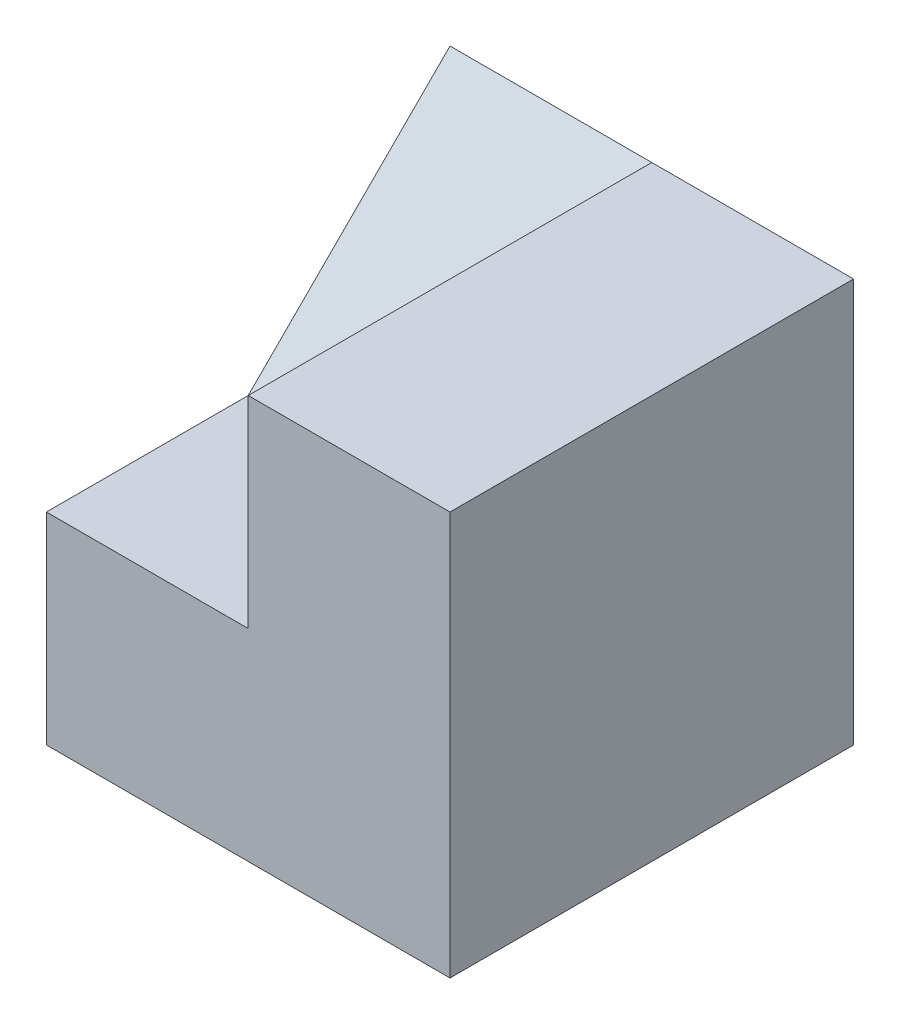
ISO-10303-21;
HEADER;
FILE_DESCRIPTION(('STEP AP214'),'2;1');
FILE_NAME('part.step','',(''),(''),'','','');
FILE_SCHEMA(('AUTOMOTIVE_DESIGN { 1 0 10303 214 1 1 1 1 }'));
ENDSEC;
DATA;
#1=APPLICATION_CONTEXT('core data for automotive mechanical design processes');
#2=APPLICATION_PROTOCOL_DEFINITION('international standard','automotive_design',2000,#1);
#3=PRODUCT_CONTEXT('',#1,'mechanical');
#4=PRODUCT('Part','Part','',(#3));
#5=PRODUCT_RELATED_PRODUCT_CATEGORY('part','',(#4));
#6=PRODUCT_DEFINITION_FORMATION('','',#4);
#7=PRODUCT_DEFINITION_CONTEXT('part definition',#1,'design');
#8=PRODUCT_DEFINITION('design','',#6,#7);
#9=PRODUCT_DEFINITION_SHAPE('','',#8);
#10=(LENGTH_UNIT() NAMED_UNIT(*) SI_UNIT(.MILLI.,.METRE.));
#11=(NAMED_UNIT(*) PLANE_ANGLE_UNIT() SI_UNIT($,.RADIAN.));
#12=(NAMED_UNIT(*) SI_UNIT($,.STERADIAN.) SOLID_ANGLE_UNIT());
#13=UNCERTAINTY_MEASURE_WITH_UNIT(LENGTH_MEASURE(1.E-05),#10,'distance_accuracy_value','');
#14=(GEOMETRIC_REPRESENTATION_CONTEXT(3) GLOBAL_UNCERTAINTY_ASSIGNED_CONTEXT((#13)) GLOBAL_UNIT_ASSIGNED_CONTEXT((#10,
#11,#12)) REPRESENTATION_CONTEXT('',''));
#15=CARTESIAN_POINT('',(0.,0.,0.));
#16=DIRECTION('',(0.,0.,1.));
#17=DIRECTION('',(1.,0.,0.));
#18=AXIS2_PLACEMENT_3D('',#15,#16,#17);
#19=CARTESIAN_POINT('',(0.,4.,0.));
#20=DIRECTION('',(0.,-1.,0.));
#21=DIRECTION('',(0.,0.,-1.));
#22=AXIS2_PLACEMENT_3D('',#19,#20,#21);
#23=PLANE('',#22);
#24=DIRECTION('',(0.,0.,-1.));
#25=VECTOR('',#24,1.);
#26=CARTESIAN_POINT('',(0.,4.,0.));
#27=LINE('',#26,#25);
#28=CARTESIAN_POINT('',(0.,4.,2.));
#29=VERTEX_POINT('',#28);
#30=CARTESIAN_POINT('',(0.,4.,-2.));
#31=VERTEX_POINT('',#30);
#32=EDGE_CURVE('E149',#29,#31,#27,.T.);
#33=ORIENTED_EDGE('',*,*,#32,.F.);
#34=DIRECTION('',(1.,0.,0.));
#35=VECTOR('',#34,1.);
#36=CARTESIAN_POINT('',(-2.,4.,2.));
#37=LINE('',#36,#35);
#38=CARTESIAN_POINT('',(2.,4.,2.));
#39=VERTEX_POINT('',#38);
#40=EDGE_CURVE('E55',#29,#39,#37,.T.);
#41=ORIENTED_EDGE('',*,*,#40,.T.);
#42=DIRECTION('',(0.,0.,-1.));
#43=VECTOR('',#42,1.);
#44=CARTESIAN_POINT('',(2.,4.,2.));
#45=LINE('',#44,#43);
#46=CARTESIAN_POINT('',(2.,4.,-2.));
#47=VERTEX_POINT('',#46);
#48=EDGE_CURVE('E86',#39,#47,#45,.T.);
#49=ORIENTED_EDGE('',*,*,#48,.T.);
#50=DIRECTION('',(-1.,0.,0.));
#51=VECTOR('',#50,1.);
#52=CARTESIAN_POINT('',(-2.,4.,-2.));
#53=LINE('',#52,#51);
#54=EDGE_CURVE('E152',#47,#31,#53,.T.);
#55=ORIENTED_EDGE('',*,*,#54,.T.);
#56=EDGE_LOOP('',(#33,#41,#49,#55));
#57=FACE_BOUND('',#56,.T.);
#58=ADVANCED_FACE('F32',(#57),#23,.F.);
#59=CARTESIAN_POINT('',(2.,4.,2.));
#60=DIRECTION('',(-1.,0.,0.));
#61=DIRECTION('',(0.,0.,1.));
#62=AXIS2_PLACEMENT_3D('',#59,#60,#61);
#63=PLANE('',#62);
#64=DIRECTION('',(0.,0.,-1.));
#65=VECTOR('',#64,1.);
#66=CARTESIAN_POINT('',(2.,0.,2.));
#67=LINE('',#66,#65);
#68=CARTESIAN_POINT('',(2.,0.,2.));
#69=VERTEX_POINT('',#68);
#70=CARTESIAN_POINT('',(2.,0.,-2.));
#71=VERTEX_POINT('',#70);
#72=EDGE_CURVE('E92',#69,#71,#67,.T.);
#73=ORIENTED_EDGE('',*,*,#72,.T.);
#74=DIRECTION('',(0.,-1.,0.));
#75=VECTOR('',#74,1.);
#76=CARTESIAN_POINT('',(2.,4.,-2.));
#77=LINE('',#76,#75);
#78=EDGE_CURVE('E11',#47,#71,#77,.T.);
#79=ORIENTED_EDGE('',*,*,#78,.F.);
#80=ORIENTED_EDGE('',*,*,#48,.F.);
#81=DIRECTION('',(0.,-1.,0.));
#82=VECTOR('',#81,1.);
#83=CARTESIAN_POINT('',(2.,4.,2.));
#84=LINE('',#83,#82);
#85=EDGE_CURVE('E77',#39,#69,#84,.T.);
#86=ORIENTED_EDGE('',*,*,#85,.T.);
#87=EDGE_LOOP('',(#73,#79,#80,#86));
#88=FACE_BOUND('',#87,.T.);
#89=ADVANCED_FACE('F34',(#88),#63,.F.);
#90=CARTESIAN_POINT('',(-2.,4.,-2.));
#91=DIRECTION('',(0.,0.,1.));
#92=DIRECTION('',(1.,0.,0.));
#93=AXIS2_PLACEMENT_3D('',#90,#91,#92);
#94=PLANE('',#93);
#95=DIRECTION('',(-1.,0.,0.));
#96=VECTOR('',#95,1.);
#97=CARTESIAN_POINT('',(-2.,0.,-2.));
#98=LINE('',#97,#96);
#99=CARTESIAN_POINT('',(-2.,0.,-2.));
#100=VERTEX_POINT('',#99);
#101=EDGE_CURVE('E95',#71,#100,#98,.T.);
#102=ORIENTED_EDGE('',*,*,#101,.T.);
#103=DIRECTION('',(0.,-1.,0.));
#104=VECTOR('',#103,1.);
#105=CARTESIAN_POINT('',(-2.,4.,-2.));
#106=LINE('',#105,#104);
#107=CARTESIAN_POINT('',(-2.,4.,-2.));
#108=VERTEX_POINT('',#107);
#109=EDGE_CURVE('E40',#108,#100,#106,.T.);
#110=ORIENTED_EDGE('',*,*,#109,.F.);
#111=DIRECTION('',(-1.,0.,0.));
#112=VECTOR('',#111,1.);
#113=CARTESIAN_POINT('',(0.,4.,-2.));
#114=LINE('',#113,#112);
#115=EDGE_CURVE('E119',#31,#108,#114,.T.);
#116=ORIENTED_EDGE('',*,*,#115,.F.);
#117=ORIENTED_EDGE('',*,*,#54,.F.);
#118=ORIENTED_EDGE('',*,*,#78,.T.);
#119=EDGE_LOOP('',(#102,#110,#116,#117,#118));
#120=FACE_BOUND('',#119,.T.);
#121=ADVANCED_FACE('F116',(#120),#94,.F.);
#122=CARTESIAN_POINT('',(-2.,4.,2.));
#123=DIRECTION('',(1.,0.,0.));
#124=DIRECTION('',(0.,0.,-1.));
#125=AXIS2_PLACEMENT_3D('',#122,#123,#124);
#126=PLANE('',#125);
#127=DIRECTION('',(0.,-1.,0.));
#128=VECTOR('',#127,1.);
#129=CARTESIAN_POINT('',(-2.,4.,2.));
#130=LINE('',#129,#128);
#131=CARTESIAN_POINT('',(-2.,2.,2.));
#132=VERTEX_POINT('',#131);
#133=CARTESIAN_POINT('',(-2.,0.,2.));
#134=VERTEX_POINT('',#133);
#135=EDGE_CURVE('E81',#132,#134,#130,.T.);
#136=ORIENTED_EDGE('',*,*,#135,.F.);
#137=DIRECTION('',(0.,0.,1.));
#138=VECTOR('',#137,1.);
#139=CARTESIAN_POINT('',(-2.,2.,0.));
#140=LINE('',#139,#138);
#141=CARTESIAN_POINT('',(-2.,2.,0.));
#142=VERTEX_POINT('',#141);
#143=EDGE_CURVE('E133',#142,#132,#140,.T.);
#144=ORIENTED_EDGE('',*,*,#143,.F.);
#145=DIRECTION('',(0.,-0.707106781186548,0.707106781186548));
#146=VECTOR('',#145,1.);
#147=CARTESIAN_POINT('',(-2.,1.,1.));
#148=LINE('',#147,#146);
#149=EDGE_CURVE('E113',#108,#142,#148,.T.);
#150=ORIENTED_EDGE('',*,*,#149,.F.);
#151=ORIENTED_EDGE('',*,*,#109,.T.);
#152=DIRECTION('',(0.,0.,1.));
#153=VECTOR('',#152,1.);
#154=CARTESIAN_POINT('',(-2.,0.,2.));
#155=LINE('',#154,#153);
#156=EDGE_CURVE('E87',#100,#134,#155,.T.);
#157=ORIENTED_EDGE('',*,*,#156,.T.);
#158=EDGE_LOOP('',(#136,#144,#150,#151,#157));
#159=FACE_BOUND('',#158,.T.);
#160=ADVANCED_FACE('F109',(#159),#126,.F.);
#161=CARTESIAN_POINT('',(-2.,4.,2.));
#162=DIRECTION('',(0.,0.,-1.));
#163=DIRECTION('',(-1.,0.,0.));
#164=AXIS2_PLACEMENT_3D('',#161,#162,#163);
#165=PLANE('',#164);
#166=DIRECTION('',(0.,1.,0.));
#167=VECTOR('',#166,1.);
#168=CARTESIAN_POINT('',(0.,0.,2.));
#169=LINE('',#168,#167);
#170=CARTESIAN_POINT('',(0.,2.,2.));
#171=VERTEX_POINT('',#170);
#172=EDGE_CURVE('E47',#171,#29,#169,.T.);
#173=ORIENTED_EDGE('',*,*,#172,.F.);
#174=DIRECTION('',(-1.,0.,0.));
#175=VECTOR('',#174,1.);
#176=CARTESIAN_POINT('',(0.,2.,2.));
#177=LINE('',#176,#175);
#178=EDGE_CURVE('E96',#171,#132,#177,.T.);
#179=ORIENTED_EDGE('',*,*,#178,.T.);
#180=ORIENTED_EDGE('',*,*,#135,.T.);
#181=DIRECTION('',(1.,0.,0.));
#182=VECTOR('',#181,1.);
#183=CARTESIAN_POINT('',(-2.,0.,2.));
#184=LINE('',#183,#182);
#185=EDGE_CURVE('E74',#134,#69,#184,.T.);
#186=ORIENTED_EDGE('',*,*,#185,.T.);
#187=ORIENTED_EDGE('',*,*,#85,.F.);
#188=ORIENTED_EDGE('',*,*,#40,.F.);
#189=EDGE_LOOP('',(#173,#179,#180,#186,#187,#188));
#190=FACE_BOUND('',#189,.T.);
#191=ADVANCED_FACE('F76',(#190),#165,.F.);
#192=CARTESIAN_POINT('',(0.,0.,0.));
#193=DIRECTION('',(0.,-1.,0.));
#194=DIRECTION('',(0.,0.,-1.));
#195=AXIS2_PLACEMENT_3D('',#192,#193,#194);
#196=PLANE('',#195);
#197=ORIENTED_EDGE('',*,*,#72,.F.);
#198=ORIENTED_EDGE('',*,*,#185,.F.);
#199=ORIENTED_EDGE('',*,*,#156,.F.);
#200=ORIENTED_EDGE('',*,*,#101,.F.);
#201=EDGE_LOOP('',(#197,#198,#199,#200));
#202=FACE_BOUND('',#201,.T.);
#203=ADVANCED_FACE('F94',(#202),#196,.T.);
#204=CARTESIAN_POINT('',(0.,2.,0.));
#205=DIRECTION('',(0.,-1.,0.));
#206=DIRECTION('',(0.,0.,-1.));
#207=AXIS2_PLACEMENT_3D('',#204,#205,#206);
#208=PLANE('',#207);
#209=ORIENTED_EDGE('',*,*,#143,.T.);
#210=ORIENTED_EDGE('',*,*,#178,.F.);
#211=DIRECTION('',(0.,0.,1.));
#212=VECTOR('',#211,1.);
#213=CARTESIAN_POINT('',(0.,2.,0.));
#214=LINE('',#213,#212);
#215=CARTESIAN_POINT('',(0.,2.,0.));
#216=VERTEX_POINT('',#215);
#217=EDGE_CURVE('E141',#216,#171,#214,.T.);
#218=ORIENTED_EDGE('',*,*,#217,.F.);
#219=DIRECTION('',(-1.,0.,0.));
#220=VECTOR('',#219,1.);
#221=CARTESIAN_POINT('',(0.,2.,0.));
#222=LINE('',#221,#220);
#223=EDGE_CURVE('E99',#216,#142,#222,.T.);
#224=ORIENTED_EDGE('',*,*,#223,.T.);
#225=EDGE_LOOP('',(#209,#210,#218,#224));
#226=FACE_BOUND('',#225,.T.);
#227=ADVANCED_FACE('F140',(#226),#208,.F.);
#228=CARTESIAN_POINT('',(0.,1.,1.));
#229=DIRECTION('',(0.,-0.707106781186547,-0.707106781186547));
#230=DIRECTION('',(0.,0.707106781186548,-0.707106781186548));
#231=AXIS2_PLACEMENT_3D('',#228,#229,#230);
#232=PLANE('',#231);
#233=ORIENTED_EDGE('',*,*,#149,.T.);
#234=ORIENTED_EDGE('',*,*,#223,.F.);
#235=DIRECTION('',(0.,-0.707106781186548,0.707106781186548));
#236=VECTOR('',#235,1.);
#237=CARTESIAN_POINT('',(0.,1.,1.));
#238=LINE('',#237,#236);
#239=EDGE_CURVE('E138',#31,#216,#238,.T.);
#240=ORIENTED_EDGE('',*,*,#239,.F.);
#241=ORIENTED_EDGE('',*,*,#115,.T.);
#242=EDGE_LOOP('',(#233,#234,#240,#241));
#243=FACE_BOUND('',#242,.T.);
#244=ADVANCED_FACE('F163',(#243),#232,.F.);
#245=CARTESIAN_POINT('',(0.,0.,0.));
#246=DIRECTION('',(-1.,0.,0.));
#247=DIRECTION('',(0.,0.,1.));
#248=AXIS2_PLACEMENT_3D('',#245,#246,#247);
#249=PLANE('',#248);
#250=ORIENTED_EDGE('',*,*,#32,.T.);
#251=ORIENTED_EDGE('',*,*,#239,.T.);
#252=ORIENTED_EDGE('',*,*,#217,.T.);
#253=ORIENTED_EDGE('',*,*,#172,.T.);
#254=EDGE_LOOP('',(#250,#251,#252,#253));
#255=FACE_BOUND('',#254,.T.);
#256=ADVANCED_FACE('F142',(#255),#249,.T.);
#257=CLOSED_SHELL('',(#58,#89,#121,#160,#191,#203,#227,#244,#256));
#258=MANIFOLD_SOLID_BREP('B2',#257);
#259=ADVANCED_BREP_SHAPE_REPRESENTATION('',(#18,#258),#14);
#260=SHAPE_DEFINITION_REPRESENTATION(#9,#259);
ENDSEC;
END-ISO-10303-21;
